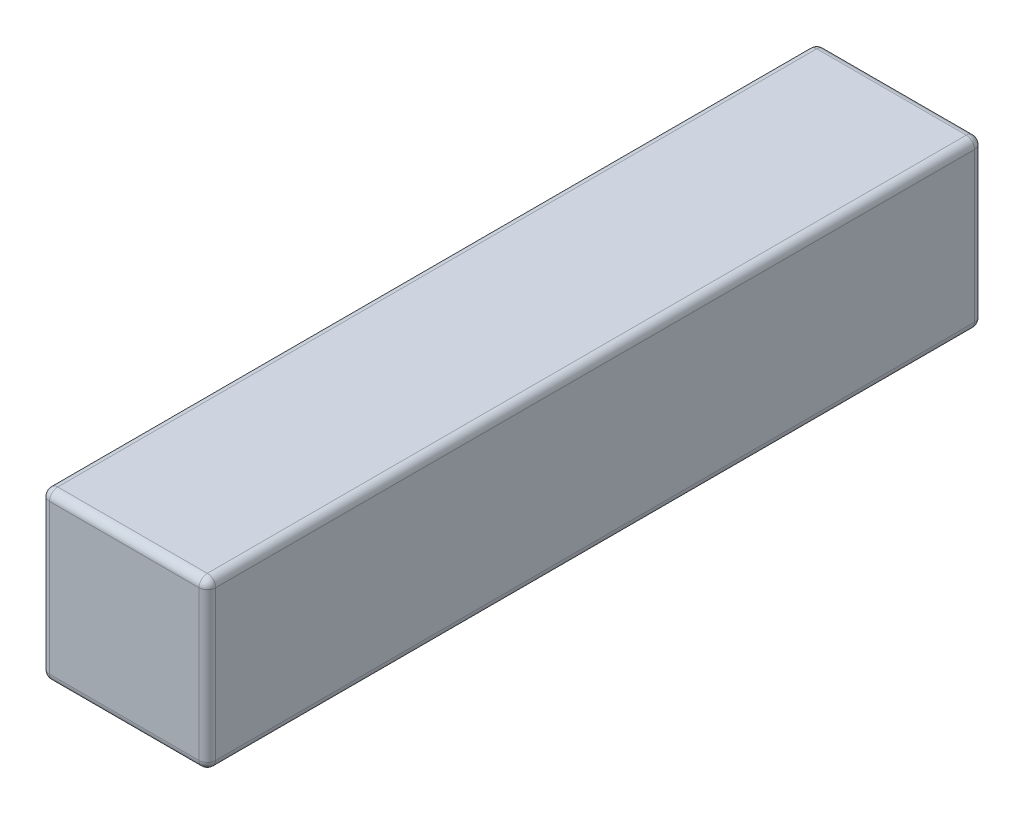
ISO-10303-21;
HEADER;
FILE_DESCRIPTION(('STEP AP214'),'2;1');
FILE_NAME('part.step','',(''),(''),'','','');
FILE_SCHEMA(('AUTOMOTIVE_DESIGN { 1 0 10303 214 1 1 1 1 }'));
ENDSEC;
DATA;
#1=APPLICATION_CONTEXT('core data for automotive mechanical design processes');
#2=APPLICATION_PROTOCOL_DEFINITION('international standard','automotive_design',2000,#1);
#3=PRODUCT_CONTEXT('',#1,'mechanical');
#4=PRODUCT('Part','Part','',(#3));
#5=PRODUCT_RELATED_PRODUCT_CATEGORY('part','',(#4));
#6=PRODUCT_DEFINITION_FORMATION('','',#4);
#7=PRODUCT_DEFINITION_CONTEXT('part definition',#1,'design');
#8=PRODUCT_DEFINITION('design','',#6,#7);
#9=PRODUCT_DEFINITION_SHAPE('','',#8);
#10=(LENGTH_UNIT() NAMED_UNIT(*) SI_UNIT(.MILLI.,.METRE.));
#11=(NAMED_UNIT(*) PLANE_ANGLE_UNIT() SI_UNIT($,.RADIAN.));
#12=(NAMED_UNIT(*) SI_UNIT($,.STERADIAN.) SOLID_ANGLE_UNIT());
#13=UNCERTAINTY_MEASURE_WITH_UNIT(LENGTH_MEASURE(1.E-05),#10,'distance_accuracy_value','');
#14=(GEOMETRIC_REPRESENTATION_CONTEXT(3) GLOBAL_UNCERTAINTY_ASSIGNED_CONTEXT((#13)) GLOBAL_UNIT_ASSIGNED_CONTEXT((#10,
#11,#12)) REPRESENTATION_CONTEXT('',''));
#15=CARTESIAN_POINT('',(0.,0.,0.));
#16=DIRECTION('',(0.,0.,1.));
#17=DIRECTION('',(1.,0.,0.));
#18=AXIS2_PLACEMENT_3D('',#15,#16,#17);
#19=CARTESIAN_POINT('',(1.5,-1.5,7.));
#20=DIRECTION('',(0.,1.,0.));
#21=DIRECTION('',(-1.,0.,0.));
#22=AXIS2_PLACEMENT_3D('',#19,#20,#21);
#23=PLANE('',#22);
#24=DIRECTION('',(1.,0.,0.));
#25=VECTOR('',#24,1.);
#26=CARTESIAN_POINT('',(1.5,-1.5,6.85));
#27=LINE('',#26,#25);
#28=CARTESIAN_POINT('',(1.35,-1.5,6.85));
#29=VERTEX_POINT('',#28);
#30=CARTESIAN_POINT('',(-1.35,-1.5,6.85));
#31=VERTEX_POINT('',#30);
#32=EDGE_CURVE('E133',#29,#31,#27,.F.);
#33=ORIENTED_EDGE('',*,*,#32,.T.);
#34=DIRECTION('',(0.,0.,-1.));
#35=VECTOR('',#34,1.);
#36=CARTESIAN_POINT('',(-1.35,-1.5,7.));
#37=LINE('',#36,#35);
#38=CARTESIAN_POINT('',(-1.35,-1.5,-6.85));
#39=VERTEX_POINT('',#38);
#40=EDGE_CURVE('E169',#31,#39,#37,.T.);
#41=ORIENTED_EDGE('',*,*,#40,.T.);
#42=DIRECTION('',(1.,0.,0.));
#43=VECTOR('',#42,1.);
#44=CARTESIAN_POINT('',(1.5,-1.5,-6.85));
#45=LINE('',#44,#43);
#46=CARTESIAN_POINT('',(1.35,-1.5,-6.85));
#47=VERTEX_POINT('',#46);
#48=EDGE_CURVE('E136',#39,#47,#45,.T.);
#49=ORIENTED_EDGE('',*,*,#48,.T.);
#50=DIRECTION('',(0.,0.,-1.));
#51=VECTOR('',#50,1.);
#52=CARTESIAN_POINT('',(1.35,-1.5,7.));
#53=LINE('',#52,#51);
#54=EDGE_CURVE('E129',#47,#29,#53,.F.);
#55=ORIENTED_EDGE('',*,*,#54,.T.);
#56=EDGE_LOOP('',(#33,#41,#49,#55));
#57=FACE_BOUND('',#56,.T.);
#58=ADVANCED_FACE('F41',(#57),#23,.F.);
#59=CARTESIAN_POINT('',(1.5,-1.5,7.));
#60=DIRECTION('',(-1.,0.,0.));
#61=DIRECTION('',(0.,0.,1.));
#62=AXIS2_PLACEMENT_3D('',#59,#60,#61);
#63=PLANE('',#62);
#64=DIRECTION('',(0.,1.,0.));
#65=VECTOR('',#64,1.);
#66=CARTESIAN_POINT('',(1.5,1.5,-6.85));
#67=LINE('',#66,#65);
#68=CARTESIAN_POINT('',(1.5,-1.35,-6.85));
#69=VERTEX_POINT('',#68);
#70=CARTESIAN_POINT('',(1.5,1.35,-6.85));
#71=VERTEX_POINT('',#70);
#72=EDGE_CURVE('E201',#69,#71,#67,.T.);
#73=ORIENTED_EDGE('',*,*,#72,.T.);
#74=DIRECTION('',(0.,0.,-1.));
#75=VECTOR('',#74,1.);
#76=CARTESIAN_POINT('',(1.5,1.35,7.));
#77=LINE('',#76,#75);
#78=CARTESIAN_POINT('',(1.5,1.35,6.85));
#79=VERTEX_POINT('',#78);
#80=EDGE_CURVE('E203',#71,#79,#77,.F.);
#81=ORIENTED_EDGE('',*,*,#80,.T.);
#82=DIRECTION('',(0.,1.,0.));
#83=VECTOR('',#82,1.);
#84=CARTESIAN_POINT('',(1.5,-1.5,6.85));
#85=LINE('',#84,#83);
#86=CARTESIAN_POINT('',(1.5,-1.35,6.85));
#87=VERTEX_POINT('',#86);
#88=EDGE_CURVE('E198',#79,#87,#85,.F.);
#89=ORIENTED_EDGE('',*,*,#88,.T.);
#90=DIRECTION('',(0.,0.,-1.));
#91=VECTOR('',#90,1.);
#92=CARTESIAN_POINT('',(1.5,-1.35,7.));
#93=LINE('',#92,#91);
#94=EDGE_CURVE('E146',#87,#69,#93,.T.);
#95=ORIENTED_EDGE('',*,*,#94,.T.);
#96=EDGE_LOOP('',(#73,#81,#89,#95));
#97=FACE_BOUND('',#96,.T.);
#98=ADVANCED_FACE('F302',(#97),#63,.F.);
#99=CARTESIAN_POINT('',(1.5,1.5,7.));
#100=DIRECTION('',(0.,-1.,0.));
#101=DIRECTION('',(1.,0.,0.));
#102=AXIS2_PLACEMENT_3D('',#99,#100,#101);
#103=PLANE('',#102);
#104=DIRECTION('',(-1.,0.,0.));
#105=VECTOR('',#104,1.);
#106=CARTESIAN_POINT('',(-1.5,1.5,-6.85));
#107=LINE('',#106,#105);
#108=CARTESIAN_POINT('',(1.35,1.5,-6.85));
#109=VERTEX_POINT('',#108);
#110=CARTESIAN_POINT('',(-1.35,1.5,-6.85));
#111=VERTEX_POINT('',#110);
#112=EDGE_CURVE('E193',#109,#111,#107,.T.);
#113=ORIENTED_EDGE('',*,*,#112,.T.);
#114=DIRECTION('',(0.,0.,-1.));
#115=VECTOR('',#114,1.);
#116=CARTESIAN_POINT('',(-1.35,1.5,7.));
#117=LINE('',#116,#115);
#118=CARTESIAN_POINT('',(-1.35,1.5,6.85));
#119=VERTEX_POINT('',#118);
#120=EDGE_CURVE('E195',#111,#119,#117,.F.);
#121=ORIENTED_EDGE('',*,*,#120,.T.);
#122=DIRECTION('',(-1.,0.,0.));
#123=VECTOR('',#122,1.);
#124=CARTESIAN_POINT('',(1.5,1.5,6.85));
#125=LINE('',#124,#123);
#126=CARTESIAN_POINT('',(1.35,1.5,6.85));
#127=VERTEX_POINT('',#126);
#128=EDGE_CURVE('E189',#119,#127,#125,.F.);
#129=ORIENTED_EDGE('',*,*,#128,.T.);
#130=DIRECTION('',(0.,0.,-1.));
#131=VECTOR('',#130,1.);
#132=CARTESIAN_POINT('',(1.35,1.5,7.));
#133=LINE('',#132,#131);
#134=EDGE_CURVE('E191',#127,#109,#133,.T.);
#135=ORIENTED_EDGE('',*,*,#134,.T.);
#136=EDGE_LOOP('',(#113,#121,#129,#135));
#137=FACE_BOUND('',#136,.T.);
#138=ADVANCED_FACE('F282',(#137),#103,.F.);
#139=CARTESIAN_POINT('',(-1.5,-1.5,7.));
#140=DIRECTION('',(1.,0.,0.));
#141=DIRECTION('',(0.,0.,-1.));
#142=AXIS2_PLACEMENT_3D('',#139,#140,#141);
#143=PLANE('',#142);
#144=DIRECTION('',(0.,-1.,0.));
#145=VECTOR('',#144,1.);
#146=CARTESIAN_POINT('',(-1.5,-1.5,-6.85));
#147=LINE('',#146,#145);
#148=CARTESIAN_POINT('',(-1.5,1.35,-6.85));
#149=VERTEX_POINT('',#148);
#150=CARTESIAN_POINT('',(-1.5,-1.35,-6.85));
#151=VERTEX_POINT('',#150);
#152=EDGE_CURVE('E175',#149,#151,#147,.T.);
#153=ORIENTED_EDGE('',*,*,#152,.T.);
#154=DIRECTION('',(0.,0.,-1.));
#155=VECTOR('',#154,1.);
#156=CARTESIAN_POINT('',(-1.5,-1.35,7.));
#157=LINE('',#156,#155);
#158=CARTESIAN_POINT('',(-1.5,-1.35,6.85));
#159=VERTEX_POINT('',#158);
#160=EDGE_CURVE('E177',#151,#159,#157,.F.);
#161=ORIENTED_EDGE('',*,*,#160,.T.);
#162=DIRECTION('',(0.,-1.,0.));
#163=VECTOR('',#162,1.);
#164=CARTESIAN_POINT('',(-1.5,-1.5,6.85));
#165=LINE('',#164,#163);
#166=CARTESIAN_POINT('',(-1.5,1.35,6.85));
#167=VERTEX_POINT('',#166);
#168=EDGE_CURVE('E171',#159,#167,#165,.F.);
#169=ORIENTED_EDGE('',*,*,#168,.T.);
#170=DIRECTION('',(0.,0.,-1.));
#171=VECTOR('',#170,1.);
#172=CARTESIAN_POINT('',(-1.5,1.35,7.));
#173=LINE('',#172,#171);
#174=EDGE_CURVE('E173',#167,#149,#173,.T.);
#175=ORIENTED_EDGE('',*,*,#174,.T.);
#176=EDGE_LOOP('',(#153,#161,#169,#175));
#177=FACE_BOUND('',#176,.T.);
#178=ADVANCED_FACE('F309',(#177),#143,.F.);
#179=CARTESIAN_POINT('',(0.,0.,7.));
#180=DIRECTION('',(0.,0.,-1.));
#181=DIRECTION('',(-1.,0.,0.));
#182=AXIS2_PLACEMENT_3D('',#179,#180,#181);
#183=PLANE('',#182);
#184=DIRECTION('',(-1.,0.,0.));
#185=VECTOR('',#184,1.);
#186=CARTESIAN_POINT('',(0.,1.35,7.));
#187=LINE('',#186,#185);
#188=CARTESIAN_POINT('',(1.35,1.35,7.));
#189=VERTEX_POINT('',#188);
#190=CARTESIAN_POINT('',(-1.35,1.35,7.));
#191=VERTEX_POINT('',#190);
#192=EDGE_CURVE('E50',#189,#191,#187,.T.);
#193=ORIENTED_EDGE('',*,*,#192,.T.);
#194=DIRECTION('',(0.,-1.,0.));
#195=VECTOR('',#194,1.);
#196=CARTESIAN_POINT('',(-1.35,0.,7.));
#197=LINE('',#196,#195);
#198=CARTESIAN_POINT('',(-1.35,-1.35,7.));
#199=VERTEX_POINT('',#198);
#200=EDGE_CURVE('E11',#191,#199,#197,.T.);
#201=ORIENTED_EDGE('',*,*,#200,.T.);
#202=DIRECTION('',(1.,0.,0.));
#203=VECTOR('',#202,1.);
#204=CARTESIAN_POINT('',(0.,-1.35,7.));
#205=LINE('',#204,#203);
#206=CARTESIAN_POINT('',(1.35,-1.35,7.));
#207=VERTEX_POINT('',#206);
#208=EDGE_CURVE('E206',#199,#207,#205,.T.);
#209=ORIENTED_EDGE('',*,*,#208,.T.);
#210=DIRECTION('',(0.,1.,0.));
#211=VECTOR('',#210,1.);
#212=CARTESIAN_POINT('',(1.35,0.,7.));
#213=LINE('',#212,#211);
#214=EDGE_CURVE('E61',#207,#189,#213,.T.);
#215=ORIENTED_EDGE('',*,*,#214,.T.);
#216=EDGE_LOOP('',(#193,#201,#209,#215));
#217=FACE_BOUND('',#216,.T.);
#218=ADVANCED_FACE('F373',(#217),#183,.F.);
#219=CARTESIAN_POINT('',(0.,0.,-7.));
#220=DIRECTION('',(0.,0.,-1.));
#221=DIRECTION('',(-1.,0.,0.));
#222=AXIS2_PLACEMENT_3D('',#219,#220,#221);
#223=PLANE('',#222);
#224=DIRECTION('',(1.,0.,0.));
#225=VECTOR('',#224,1.);
#226=CARTESIAN_POINT('',(-1.5,-1.35,-7.));
#227=LINE('',#226,#225);
#228=CARTESIAN_POINT('',(1.35,-1.35,-7.));
#229=VERTEX_POINT('',#228);
#230=CARTESIAN_POINT('',(-1.35,-1.35,-7.));
#231=VERTEX_POINT('',#230);
#232=EDGE_CURVE('E184',#229,#231,#227,.F.);
#233=ORIENTED_EDGE('',*,*,#232,.T.);
#234=DIRECTION('',(0.,-1.,0.));
#235=VECTOR('',#234,1.);
#236=CARTESIAN_POINT('',(-1.35,1.5,-7.));
#237=LINE('',#236,#235);
#238=CARTESIAN_POINT('',(-1.35,1.35,-7.));
#239=VERTEX_POINT('',#238);
#240=EDGE_CURVE('E186',#231,#239,#237,.F.);
#241=ORIENTED_EDGE('',*,*,#240,.T.);
#242=DIRECTION('',(-1.,0.,0.));
#243=VECTOR('',#242,1.);
#244=CARTESIAN_POINT('',(1.5,1.35,-7.));
#245=LINE('',#244,#243);
#246=CARTESIAN_POINT('',(1.35,1.35,-7.));
#247=VERTEX_POINT('',#246);
#248=EDGE_CURVE('E182',#239,#247,#245,.F.);
#249=ORIENTED_EDGE('',*,*,#248,.T.);
#250=DIRECTION('',(0.,1.,0.));
#251=VECTOR('',#250,1.);
#252=CARTESIAN_POINT('',(1.35,-1.5,-7.));
#253=LINE('',#252,#251);
#254=EDGE_CURVE('E180',#247,#229,#253,.F.);
#255=ORIENTED_EDGE('',*,*,#254,.T.);
#256=EDGE_LOOP('',(#233,#241,#249,#255));
#257=FACE_BOUND('',#256,.T.);
#258=ADVANCED_FACE('F273',(#257),#223,.T.);
#259=CARTESIAN_POINT('',(1.35,1.35,7.));
#260=DIRECTION('',(0.,0.,-1.));
#261=DIRECTION('',(-1.,0.,0.));
#262=AXIS2_PLACEMENT_3D('',#259,#260,#261);
#263=CYLINDRICAL_SURFACE('',#262,0.15);
#264=CARTESIAN_POINT('',(1.35,1.35,6.85));
#265=DIRECTION('',(0.,0.,1.));
#266=DIRECTION('',(1.,0.,0.));
#267=AXIS2_PLACEMENT_3D('',#264,#265,#266);
#268=CIRCLE('',#267,0.15);
#269=EDGE_CURVE('E45',#79,#127,#268,.T.);
#270=ORIENTED_EDGE('',*,*,#269,.F.);
#271=ORIENTED_EDGE('',*,*,#80,.F.);
#272=CARTESIAN_POINT('',(1.35,1.35,-6.85));
#273=DIRECTION('',(0.,0.,-1.));
#274=DIRECTION('',(-1.,0.,0.));
#275=AXIS2_PLACEMENT_3D('',#272,#273,#274);
#276=CIRCLE('',#275,0.15);
#277=EDGE_CURVE('E166',#109,#71,#276,.T.);
#278=ORIENTED_EDGE('',*,*,#277,.F.);
#279=ORIENTED_EDGE('',*,*,#134,.F.);
#280=EDGE_LOOP('',(#270,#271,#278,#279));
#281=FACE_BOUND('',#280,.T.);
#282=ADVANCED_FACE('F43',(#281),#263,.T.);
#283=CARTESIAN_POINT('',(1.35,1.35,6.85));
#284=DIRECTION('',(0.,0.,1.));
#285=DIRECTION('',(1.,0.,0.));
#286=AXIS2_PLACEMENT_3D('',#283,#284,#285);
#287=SPHERICAL_SURFACE('',#286,0.15);
#288=CARTESIAN_POINT('',(1.35,1.35,6.85));
#289=DIRECTION('',(0.,1.,0.));
#290=DIRECTION('',(0.,0.,1.));
#291=AXIS2_PLACEMENT_3D('',#288,#289,#290);
#292=CIRCLE('',#291,0.15);
#293=EDGE_CURVE('E252',#79,#189,#292,.F.);
#294=ORIENTED_EDGE('',*,*,#293,.F.);
#295=ORIENTED_EDGE('',*,*,#269,.T.);
#296=CARTESIAN_POINT('',(1.35,1.35,6.85));
#297=DIRECTION('',(1.,0.,0.));
#298=DIRECTION('',(0.,0.,-1.));
#299=AXIS2_PLACEMENT_3D('',#296,#297,#298);
#300=CIRCLE('',#299,0.15);
#301=EDGE_CURVE('E254',#189,#127,#300,.F.);
#302=ORIENTED_EDGE('',*,*,#301,.F.);
#303=EDGE_LOOP('',(#294,#295,#302));
#304=FACE_BOUND('',#303,.T.);
#305=ADVANCED_FACE('F298',(#304),#287,.T.);
#306=CARTESIAN_POINT('',(1.35,1.35,-6.85));
#307=DIRECTION('',(0.,0.,1.));
#308=DIRECTION('',(1.,0.,0.));
#309=AXIS2_PLACEMENT_3D('',#306,#307,#308);
#310=SPHERICAL_SURFACE('',#309,0.15);
#311=CARTESIAN_POINT('',(1.35,1.35,-6.85));
#312=DIRECTION('',(1.,0.,0.));
#313=DIRECTION('',(0.,0.,-1.));
#314=AXIS2_PLACEMENT_3D('',#311,#312,#313);
#315=CIRCLE('',#314,0.15);
#316=EDGE_CURVE('E246',#109,#247,#315,.F.);
#317=ORIENTED_EDGE('',*,*,#316,.F.);
#318=ORIENTED_EDGE('',*,*,#277,.T.);
#319=CARTESIAN_POINT('',(1.35,1.35,-6.85));
#320=DIRECTION('',(0.,1.,0.));
#321=DIRECTION('',(0.,0.,1.));
#322=AXIS2_PLACEMENT_3D('',#319,#320,#321);
#323=CIRCLE('',#322,0.15);
#324=EDGE_CURVE('E249',#247,#71,#323,.F.);
#325=ORIENTED_EDGE('',*,*,#324,.F.);
#326=EDGE_LOOP('',(#317,#318,#325));
#327=FACE_BOUND('',#326,.T.);
#328=ADVANCED_FACE('F261',(#327),#310,.T.);
#329=CARTESIAN_POINT('',(0.,1.35,6.85));
#330=DIRECTION('',(-1.,0.,0.));
#331=DIRECTION('',(0.,-1.,0.));
#332=AXIS2_PLACEMENT_3D('',#329,#330,#331);
#333=CYLINDRICAL_SURFACE('',#332,0.15);
#334=ORIENTED_EDGE('',*,*,#301,.T.);
#335=ORIENTED_EDGE('',*,*,#128,.F.);
#336=CARTESIAN_POINT('',(-1.35,1.35,6.85));
#337=DIRECTION('',(-1.,0.,0.));
#338=DIRECTION('',(0.,0.,1.));
#339=AXIS2_PLACEMENT_3D('',#336,#337,#338);
#340=CIRCLE('',#339,0.15);
#341=EDGE_CURVE('E241',#191,#119,#340,.T.);
#342=ORIENTED_EDGE('',*,*,#341,.F.);
#343=ORIENTED_EDGE('',*,*,#192,.F.);
#344=EDGE_LOOP('',(#334,#335,#342,#343));
#345=FACE_BOUND('',#344,.T.);
#346=ADVANCED_FACE('F293',(#345),#333,.T.);
#347=CARTESIAN_POINT('',(1.35,0.,6.85));
#348=DIRECTION('',(0.,1.,0.));
#349=DIRECTION('',(0.,0.,1.));
#350=AXIS2_PLACEMENT_3D('',#347,#348,#349);
#351=CYLINDRICAL_SURFACE('',#350,0.15);
#352=ORIENTED_EDGE('',*,*,#293,.T.);
#353=ORIENTED_EDGE('',*,*,#214,.F.);
#354=CARTESIAN_POINT('',(1.35,-1.35,6.85));
#355=DIRECTION('',(0.,-1.,0.));
#356=DIRECTION('',(0.,0.,-1.));
#357=AXIS2_PLACEMENT_3D('',#354,#355,#356);
#358=CIRCLE('',#357,0.15);
#359=EDGE_CURVE('E150',#87,#207,#358,.T.);
#360=ORIENTED_EDGE('',*,*,#359,.F.);
#361=ORIENTED_EDGE('',*,*,#88,.F.);
#362=EDGE_LOOP('',(#352,#353,#360,#361));
#363=FACE_BOUND('',#362,.T.);
#364=ADVANCED_FACE('F300',(#363),#351,.T.);
#365=CARTESIAN_POINT('',(1.35,-1.35,7.));
#366=DIRECTION('',(0.,0.,-1.));
#367=DIRECTION('',(-1.,0.,0.));
#368=AXIS2_PLACEMENT_3D('',#365,#366,#367);
#369=CYLINDRICAL_SURFACE('',#368,0.15);
#370=CARTESIAN_POINT('',(1.35,-1.35,-6.85));
#371=DIRECTION('',(0.,0.,-1.));
#372=DIRECTION('',(-1.,0.,0.));
#373=AXIS2_PLACEMENT_3D('',#370,#371,#372);
#374=CIRCLE('',#373,0.15);
#375=EDGE_CURVE('E151',#69,#47,#374,.T.);
#376=ORIENTED_EDGE('',*,*,#375,.F.);
#377=ORIENTED_EDGE('',*,*,#94,.F.);
#378=CARTESIAN_POINT('',(1.35,-1.35,6.85));
#379=DIRECTION('',(0.,0.,1.));
#380=DIRECTION('',(1.,0.,0.));
#381=AXIS2_PLACEMENT_3D('',#378,#379,#380);
#382=CIRCLE('',#381,0.15);
#383=EDGE_CURVE('E143',#29,#87,#382,.T.);
#384=ORIENTED_EDGE('',*,*,#383,.F.);
#385=ORIENTED_EDGE('',*,*,#54,.F.);
#386=EDGE_LOOP('',(#376,#377,#384,#385));
#387=FACE_BOUND('',#386,.T.);
#388=ADVANCED_FACE('F145',(#387),#369,.T.);
#389=CARTESIAN_POINT('',(1.35,-1.5,-6.85));
#390=DIRECTION('',(0.,-1.,0.));
#391=DIRECTION('',(0.,0.,-1.));
#392=AXIS2_PLACEMENT_3D('',#389,#390,#391);
#393=CYLINDRICAL_SURFACE('',#392,0.15);
#394=ORIENTED_EDGE('',*,*,#324,.T.);
#395=ORIENTED_EDGE('',*,*,#72,.F.);
#396=CARTESIAN_POINT('',(1.35,-1.35,-6.85));
#397=DIRECTION('',(0.,-1.,0.));
#398=DIRECTION('',(0.,0.,-1.));
#399=AXIS2_PLACEMENT_3D('',#396,#397,#398);
#400=CIRCLE('',#399,0.15);
#401=EDGE_CURVE('E236',#229,#69,#400,.T.);
#402=ORIENTED_EDGE('',*,*,#401,.F.);
#403=ORIENTED_EDGE('',*,*,#254,.F.);
#404=EDGE_LOOP('',(#394,#395,#402,#403));
#405=FACE_BOUND('',#404,.T.);
#406=ADVANCED_FACE('F269',(#405),#393,.T.);
#407=CARTESIAN_POINT('',(1.5,1.35,-6.85));
#408=DIRECTION('',(1.,0.,0.));
#409=DIRECTION('',(0.,1.,0.));
#410=AXIS2_PLACEMENT_3D('',#407,#408,#409);
#411=CYLINDRICAL_SURFACE('',#410,0.15);
#412=ORIENTED_EDGE('',*,*,#316,.T.);
#413=ORIENTED_EDGE('',*,*,#248,.F.);
#414=CARTESIAN_POINT('',(-1.35,1.35,-6.85));
#415=DIRECTION('',(-1.,0.,0.));
#416=DIRECTION('',(0.,0.,1.));
#417=AXIS2_PLACEMENT_3D('',#414,#415,#416);
#418=CIRCLE('',#417,0.15);
#419=EDGE_CURVE('E233',#111,#239,#418,.T.);
#420=ORIENTED_EDGE('',*,*,#419,.F.);
#421=ORIENTED_EDGE('',*,*,#112,.F.);
#422=EDGE_LOOP('',(#412,#413,#420,#421));
#423=FACE_BOUND('',#422,.T.);
#424=ADVANCED_FACE('F279',(#423),#411,.T.);
#425=CARTESIAN_POINT('',(-1.35,1.35,7.));
#426=DIRECTION('',(0.,0.,-1.));
#427=DIRECTION('',(-1.,0.,0.));
#428=AXIS2_PLACEMENT_3D('',#425,#426,#427);
#429=CYLINDRICAL_SURFACE('',#428,0.15);
#430=CARTESIAN_POINT('',(-1.35,1.35,6.85));
#431=DIRECTION('',(0.,0.,1.));
#432=DIRECTION('',(1.,0.,0.));
#433=AXIS2_PLACEMENT_3D('',#430,#431,#432);
#434=CIRCLE('',#433,0.15);
#435=EDGE_CURVE('E243',#119,#167,#434,.T.);
#436=ORIENTED_EDGE('',*,*,#435,.F.);
#437=ORIENTED_EDGE('',*,*,#120,.F.);
#438=CARTESIAN_POINT('',(-1.35,1.35,-6.85));
#439=DIRECTION('',(0.,0.,-1.));
#440=DIRECTION('',(-1.,0.,0.));
#441=AXIS2_PLACEMENT_3D('',#438,#439,#440);
#442=CIRCLE('',#441,0.15);
#443=EDGE_CURVE('E230',#149,#111,#442,.T.);
#444=ORIENTED_EDGE('',*,*,#443,.F.);
#445=ORIENTED_EDGE('',*,*,#174,.F.);
#446=EDGE_LOOP('',(#436,#437,#444,#445));
#447=FACE_BOUND('',#446,.T.);
#448=ADVANCED_FACE('F286',(#447),#429,.T.);
#449=CARTESIAN_POINT('',(-1.35,1.35,6.85));
#450=DIRECTION('',(0.,0.,1.));
#451=DIRECTION('',(1.,0.,0.));
#452=AXIS2_PLACEMENT_3D('',#449,#450,#451);
#453=SPHERICAL_SURFACE('',#452,0.15);
#454=ORIENTED_EDGE('',*,*,#341,.T.);
#455=ORIENTED_EDGE('',*,*,#435,.T.);
#456=CARTESIAN_POINT('',(-1.35,1.35,6.85));
#457=DIRECTION('',(0.,1.,0.));
#458=DIRECTION('',(0.,0.,1.));
#459=AXIS2_PLACEMENT_3D('',#456,#457,#458);
#460=CIRCLE('',#459,0.15);
#461=EDGE_CURVE('E158',#191,#167,#460,.F.);
#462=ORIENTED_EDGE('',*,*,#461,.F.);
#463=EDGE_LOOP('',(#454,#455,#462));
#464=FACE_BOUND('',#463,.T.);
#465=ADVANCED_FACE('F350',(#464),#453,.T.);
#466=CARTESIAN_POINT('',(1.35,-1.35,6.85));
#467=DIRECTION('',(0.,0.,1.));
#468=DIRECTION('',(1.,0.,0.));
#469=AXIS2_PLACEMENT_3D('',#466,#467,#468);
#470=SPHERICAL_SURFACE('',#469,0.15);
#471=ORIENTED_EDGE('',*,*,#383,.T.);
#472=ORIENTED_EDGE('',*,*,#359,.T.);
#473=CARTESIAN_POINT('',(1.35,-1.35,6.85));
#474=DIRECTION('',(1.,0.,0.));
#475=DIRECTION('',(0.,0.,-1.));
#476=AXIS2_PLACEMENT_3D('',#473,#474,#475);
#477=CIRCLE('',#476,0.15);
#478=EDGE_CURVE('E154',#29,#207,#477,.F.);
#479=ORIENTED_EDGE('',*,*,#478,.F.);
#480=EDGE_LOOP('',(#471,#472,#479));
#481=FACE_BOUND('',#480,.T.);
#482=ADVANCED_FACE('F155',(#481),#470,.T.);
#483=CARTESIAN_POINT('',(1.35,-1.35,-6.85));
#484=DIRECTION('',(0.,0.,1.));
#485=DIRECTION('',(1.,0.,0.));
#486=AXIS2_PLACEMENT_3D('',#483,#484,#485);
#487=SPHERICAL_SURFACE('',#486,0.15);
#488=ORIENTED_EDGE('',*,*,#401,.T.);
#489=ORIENTED_EDGE('',*,*,#375,.T.);
#490=CARTESIAN_POINT('',(1.35,-1.35,-6.85));
#491=DIRECTION('',(1.,0.,0.));
#492=DIRECTION('',(0.,0.,-1.));
#493=AXIS2_PLACEMENT_3D('',#490,#491,#492);
#494=CIRCLE('',#493,0.15);
#495=EDGE_CURVE('E159',#229,#47,#494,.F.);
#496=ORIENTED_EDGE('',*,*,#495,.F.);
#497=EDGE_LOOP('',(#488,#489,#496));
#498=FACE_BOUND('',#497,.T.);
#499=ADVANCED_FACE('F343',(#498),#487,.T.);
#500=CARTESIAN_POINT('',(-1.35,1.35,-6.85));
#501=DIRECTION('',(0.,0.,1.));
#502=DIRECTION('',(1.,0.,0.));
#503=AXIS2_PLACEMENT_3D('',#500,#501,#502);
#504=SPHERICAL_SURFACE('',#503,0.15);
#505=ORIENTED_EDGE('',*,*,#443,.T.);
#506=ORIENTED_EDGE('',*,*,#419,.T.);
#507=CARTESIAN_POINT('',(-1.35,1.35,-6.85));
#508=DIRECTION('',(0.,1.,0.));
#509=DIRECTION('',(0.,0.,1.));
#510=AXIS2_PLACEMENT_3D('',#507,#508,#509);
#511=CIRCLE('',#510,0.15);
#512=EDGE_CURVE('E224',#149,#239,#511,.F.);
#513=ORIENTED_EDGE('',*,*,#512,.F.);
#514=EDGE_LOOP('',(#505,#506,#513));
#515=FACE_BOUND('',#514,.T.);
#516=ADVANCED_FACE('F339',(#515),#504,.T.);
#517=CARTESIAN_POINT('',(-1.35,0.,6.85));
#518=DIRECTION('',(0.,-1.,0.));
#519=DIRECTION('',(0.,0.,-1.));
#520=AXIS2_PLACEMENT_3D('',#517,#518,#519);
#521=CYLINDRICAL_SURFACE('',#520,0.15);
#522=ORIENTED_EDGE('',*,*,#461,.T.);
#523=ORIENTED_EDGE('',*,*,#168,.F.);
#524=CARTESIAN_POINT('',(-1.35,-1.35,6.85));
#525=DIRECTION('',(0.,-1.,0.));
#526=DIRECTION('',(0.,0.,-1.));
#527=AXIS2_PLACEMENT_3D('',#524,#525,#526);
#528=CIRCLE('',#527,0.15);
#529=EDGE_CURVE('E221',#199,#159,#528,.T.);
#530=ORIENTED_EDGE('',*,*,#529,.F.);
#531=ORIENTED_EDGE('',*,*,#200,.F.);
#532=EDGE_LOOP('',(#522,#523,#530,#531));
#533=FACE_BOUND('',#532,.T.);
#534=ADVANCED_FACE('F336',(#533),#521,.T.);
#535=CARTESIAN_POINT('',(0.,-1.35,6.85));
#536=DIRECTION('',(1.,0.,0.));
#537=DIRECTION('',(0.,1.,0.));
#538=AXIS2_PLACEMENT_3D('',#535,#536,#537);
#539=CYLINDRICAL_SURFACE('',#538,0.15);
#540=ORIENTED_EDGE('',*,*,#478,.T.);
#541=ORIENTED_EDGE('',*,*,#208,.F.);
#542=CARTESIAN_POINT('',(-1.35,-1.35,6.85));
#543=DIRECTION('',(-1.,0.,0.));
#544=DIRECTION('',(0.,0.,1.));
#545=AXIS2_PLACEMENT_3D('',#542,#543,#544);
#546=CIRCLE('',#545,0.15);
#547=EDGE_CURVE('E162',#31,#199,#546,.T.);
#548=ORIENTED_EDGE('',*,*,#547,.F.);
#549=ORIENTED_EDGE('',*,*,#32,.F.);
#550=EDGE_LOOP('',(#540,#541,#548,#549));
#551=FACE_BOUND('',#550,.T.);
#552=ADVANCED_FACE('F161',(#551),#539,.T.);
#553=CARTESIAN_POINT('',(1.5,-1.35,-6.85));
#554=DIRECTION('',(-1.,0.,0.));
#555=DIRECTION('',(0.,-1.,0.));
#556=AXIS2_PLACEMENT_3D('',#553,#554,#555);
#557=CYLINDRICAL_SURFACE('',#556,0.15);
#558=ORIENTED_EDGE('',*,*,#495,.T.);
#559=ORIENTED_EDGE('',*,*,#48,.F.);
#560=CARTESIAN_POINT('',(-1.35,-1.35,-6.85));
#561=DIRECTION('',(-1.,0.,0.));
#562=DIRECTION('',(0.,0.,1.));
#563=AXIS2_PLACEMENT_3D('',#560,#561,#562);
#564=CIRCLE('',#563,0.15);
#565=EDGE_CURVE('E217',#231,#39,#564,.T.);
#566=ORIENTED_EDGE('',*,*,#565,.F.);
#567=ORIENTED_EDGE('',*,*,#232,.F.);
#568=EDGE_LOOP('',(#558,#559,#566,#567));
#569=FACE_BOUND('',#568,.T.);
#570=ADVANCED_FACE('F329',(#569),#557,.T.);
#571=CARTESIAN_POINT('',(-1.35,-1.5,-6.85));
#572=DIRECTION('',(0.,1.,0.));
#573=DIRECTION('',(0.,0.,1.));
#574=AXIS2_PLACEMENT_3D('',#571,#572,#573);
#575=CYLINDRICAL_SURFACE('',#574,0.15);
#576=ORIENTED_EDGE('',*,*,#512,.T.);
#577=ORIENTED_EDGE('',*,*,#240,.F.);
#578=CARTESIAN_POINT('',(-1.35,-1.35,-6.85));
#579=DIRECTION('',(0.,-1.,0.));
#580=DIRECTION('',(0.,0.,-1.));
#581=AXIS2_PLACEMENT_3D('',#578,#579,#580);
#582=CIRCLE('',#581,0.15);
#583=EDGE_CURVE('E214',#151,#231,#582,.T.);
#584=ORIENTED_EDGE('',*,*,#583,.F.);
#585=ORIENTED_EDGE('',*,*,#152,.F.);
#586=EDGE_LOOP('',(#576,#577,#584,#585));
#587=FACE_BOUND('',#586,.T.);
#588=ADVANCED_FACE('F325',(#587),#575,.T.);
#589=CARTESIAN_POINT('',(-1.35,-1.35,6.85));
#590=DIRECTION('',(0.,0.,1.));
#591=DIRECTION('',(1.,0.,0.));
#592=AXIS2_PLACEMENT_3D('',#589,#590,#591);
#593=SPHERICAL_SURFACE('',#592,0.15);
#594=ORIENTED_EDGE('',*,*,#547,.T.);
#595=ORIENTED_EDGE('',*,*,#529,.T.);
#596=CARTESIAN_POINT('',(-1.35,-1.35,6.85));
#597=DIRECTION('',(0.,0.,1.));
#598=DIRECTION('',(1.,0.,0.));
#599=AXIS2_PLACEMENT_3D('',#596,#597,#598);
#600=CIRCLE('',#599,0.15);
#601=EDGE_CURVE('E212',#31,#159,#600,.F.);
#602=ORIENTED_EDGE('',*,*,#601,.F.);
#603=EDGE_LOOP('',(#594,#595,#602));
#604=FACE_BOUND('',#603,.T.);
#605=ADVANCED_FACE('F321',(#604),#593,.T.);
#606=CARTESIAN_POINT('',(-1.35,-1.35,-6.85));
#607=DIRECTION('',(0.,0.,1.));
#608=DIRECTION('',(1.,0.,0.));
#609=AXIS2_PLACEMENT_3D('',#606,#607,#608);
#610=SPHERICAL_SURFACE('',#609,0.15);
#611=ORIENTED_EDGE('',*,*,#583,.T.);
#612=ORIENTED_EDGE('',*,*,#565,.T.);
#613=CARTESIAN_POINT('',(-1.35,-1.35,-6.85));
#614=DIRECTION('',(0.,0.,-1.));
#615=DIRECTION('',(-1.,0.,0.));
#616=AXIS2_PLACEMENT_3D('',#613,#614,#615);
#617=CIRCLE('',#616,0.15);
#618=EDGE_CURVE('E210',#151,#39,#617,.F.);
#619=ORIENTED_EDGE('',*,*,#618,.F.);
#620=EDGE_LOOP('',(#611,#612,#619));
#621=FACE_BOUND('',#620,.T.);
#622=ADVANCED_FACE('F317',(#621),#610,.T.);
#623=CARTESIAN_POINT('',(-1.35,-1.35,7.));
#624=DIRECTION('',(0.,0.,-1.));
#625=DIRECTION('',(-1.,0.,0.));
#626=AXIS2_PLACEMENT_3D('',#623,#624,#625);
#627=CYLINDRICAL_SURFACE('',#626,0.15);
#628=ORIENTED_EDGE('',*,*,#601,.T.);
#629=ORIENTED_EDGE('',*,*,#160,.F.);
#630=ORIENTED_EDGE('',*,*,#618,.T.);
#631=ORIENTED_EDGE('',*,*,#40,.F.);
#632=EDGE_LOOP('',(#628,#629,#630,#631));
#633=FACE_BOUND('',#632,.T.);
#634=ADVANCED_FACE('F314',(#633),#627,.T.);
#635=CLOSED_SHELL('',(#58,#98,#138,#178,#218,#258,#282,#305,#328,#346,#364,#388,#406,#424,#448,
#465,#482,#499,#516,#534,#552,#570,#588,#605,#622,#634));
#636=MANIFOLD_SOLID_BREP('B2',#635);
#637=ADVANCED_BREP_SHAPE_REPRESENTATION('',(#18,#636),#14);
#638=SHAPE_DEFINITION_REPRESENTATION(#9,#637);
ENDSEC;
END-ISO-10303-21;
